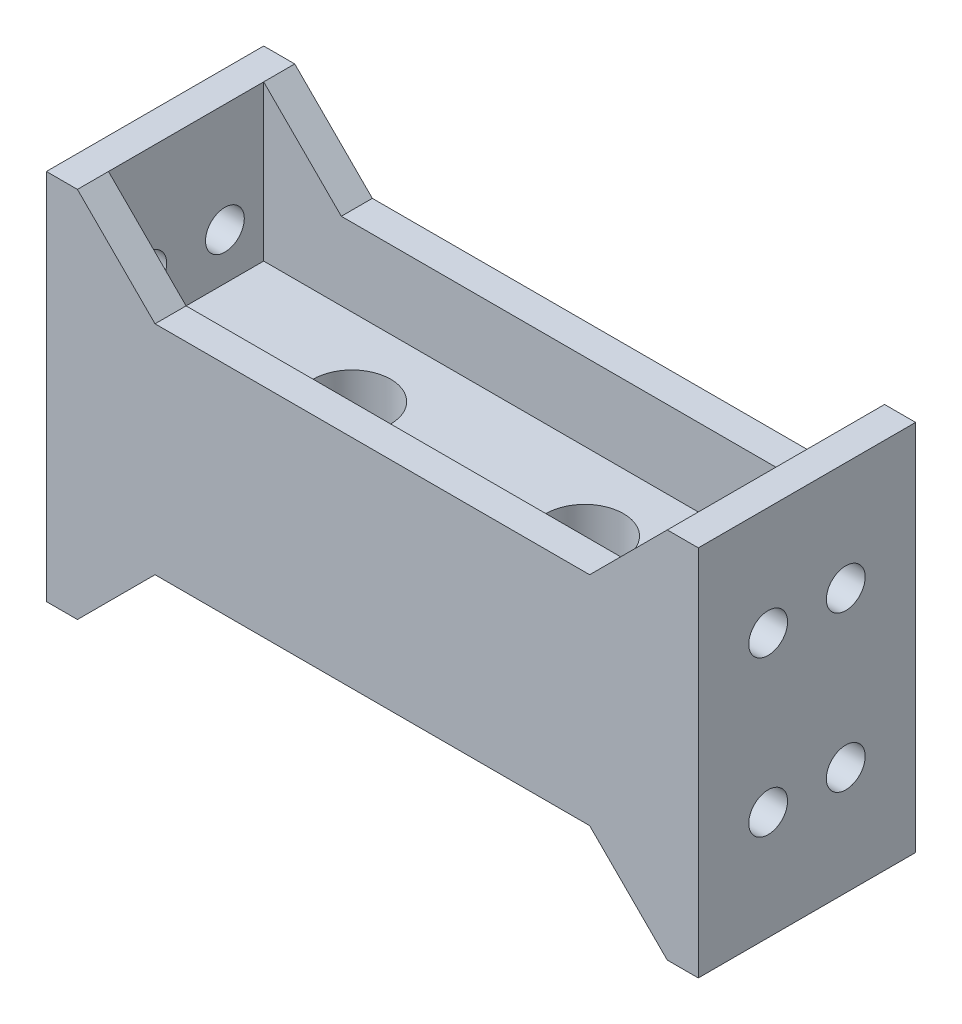
ISO-10303-21;
HEADER;
FILE_DESCRIPTION(('STEP AP214'),'2;1');
FILE_NAME('part.step','',(''),(''),'','','');
FILE_SCHEMA(('AUTOMOTIVE_DESIGN { 1 0 10303 214 1 1 1 1 }'));
ENDSEC;
DATA;
#1=APPLICATION_CONTEXT('core data for automotive mechanical design processes');
#2=APPLICATION_PROTOCOL_DEFINITION('international standard','automotive_design',2000,#1);
#3=PRODUCT_CONTEXT('',#1,'mechanical');
#4=PRODUCT('Part','Part','',(#3));
#5=PRODUCT_RELATED_PRODUCT_CATEGORY('part','',(#4));
#6=PRODUCT_DEFINITION_FORMATION('','',#4);
#7=PRODUCT_DEFINITION_CONTEXT('part definition',#1,'design');
#8=PRODUCT_DEFINITION('design','',#6,#7);
#9=PRODUCT_DEFINITION_SHAPE('','',#8);
#10=(LENGTH_UNIT() NAMED_UNIT(*) SI_UNIT(.MILLI.,.METRE.));
#11=(NAMED_UNIT(*) PLANE_ANGLE_UNIT() SI_UNIT($,.RADIAN.));
#12=(NAMED_UNIT(*) SI_UNIT($,.STERADIAN.) SOLID_ANGLE_UNIT());
#13=UNCERTAINTY_MEASURE_WITH_UNIT(LENGTH_MEASURE(1.E-05),#10,'distance_accuracy_value','');
#14=(GEOMETRIC_REPRESENTATION_CONTEXT(3) GLOBAL_UNCERTAINTY_ASSIGNED_CONTEXT((#13)) GLOBAL_UNIT_ASSIGNED_CONTEXT((#10,
#11,#12)) REPRESENTATION_CONTEXT('',''));
#15=CARTESIAN_POINT('',(0.,0.,0.));
#16=DIRECTION('',(0.,0.,1.));
#17=DIRECTION('',(1.,0.,0.));
#18=AXIS2_PLACEMENT_3D('',#15,#16,#17);
#19=CARTESIAN_POINT('',(0.,4.,0.));
#20=DIRECTION('',(0.,1.,0.));
#21=DIRECTION('',(0.,0.,1.));
#22=AXIS2_PLACEMENT_3D('',#19,#20,#21);
#23=PLANE('',#22);
#24=CARTESIAN_POINT('',(-8.31990662492034,4.,0.));
#25=DIRECTION('',(0.,-1.,0.));
#26=DIRECTION('',(0.,0.,-1.));
#27=AXIS2_PLACEMENT_3D('',#24,#25,#26);
#28=CIRCLE('',#27,2.5);
#29=CARTESIAN_POINT('',(-8.31990662492034,4.,-2.5));
#30=VERTEX_POINT('',#29);
#31=EDGE_CURVE('E284',#30,#30,#28,.T.);
#32=ORIENTED_EDGE('',*,*,#31,.T.);
#33=EDGE_LOOP('',(#32));
#34=FACE_BOUND('',#33,.T.);
#35=CARTESIAN_POINT('',(6.68009337507966,4.,0.));
#36=DIRECTION('',(0.,-1.,0.));
#37=DIRECTION('',(0.,0.,-1.));
#38=AXIS2_PLACEMENT_3D('',#35,#36,#37);
#39=CIRCLE('',#38,2.5);
#40=CARTESIAN_POINT('',(6.68009337507966,4.,-2.5));
#41=VERTEX_POINT('',#40);
#42=EDGE_CURVE('E272',#41,#41,#39,.T.);
#43=ORIENTED_EDGE('',*,*,#42,.T.);
#44=EDGE_LOOP('',(#43));
#45=FACE_BOUND('',#44,.T.);
#46=DIRECTION('',(0.,0.,-1.));
#47=VECTOR('',#46,1.);
#48=CARTESIAN_POINT('',(-19.,4.,-7.));
#49=LINE('',#48,#47);
#50=CARTESIAN_POINT('',(-19.,4.,5.));
#51=VERTEX_POINT('',#50);
#52=CARTESIAN_POINT('',(-19.,4.,-5.));
#53=VERTEX_POINT('',#52);
#54=EDGE_CURVE('E247',#51,#53,#49,.T.);
#55=ORIENTED_EDGE('',*,*,#54,.F.);
#56=DIRECTION('',(-1.,0.,0.));
#57=VECTOR('',#56,1.);
#58=CARTESIAN_POINT('',(19.,4.,5.));
#59=LINE('',#58,#57);
#60=CARTESIAN_POINT('',(19.,4.,5.));
#61=VERTEX_POINT('',#60);
#62=EDGE_CURVE('E206',#61,#51,#59,.T.);
#63=ORIENTED_EDGE('',*,*,#62,.F.);
#64=DIRECTION('',(0.,0.,1.));
#65=VECTOR('',#64,1.);
#66=CARTESIAN_POINT('',(19.,4.,-7.));
#67=LINE('',#66,#65);
#68=CARTESIAN_POINT('',(19.,4.,-5.));
#69=VERTEX_POINT('',#68);
#70=EDGE_CURVE('E451',#69,#61,#67,.T.);
#71=ORIENTED_EDGE('',*,*,#70,.F.);
#72=DIRECTION('',(-1.,0.,0.));
#73=VECTOR('',#72,1.);
#74=CARTESIAN_POINT('',(19.,4.,-5.));
#75=LINE('',#74,#73);
#76=EDGE_CURVE('E527',#69,#53,#75,.T.);
#77=ORIENTED_EDGE('',*,*,#76,.T.);
#78=EDGE_LOOP('',(#55,#63,#71,#77));
#79=FACE_BOUND('',#78,.T.);
#80=ADVANCED_FACE('F39',(#34,#45,#79),#23,.T.);
#81=CARTESIAN_POINT('',(-19.,14.,-7.));
#82=DIRECTION('',(-1.,0.,0.));
#83=DIRECTION('',(0.,0.,1.));
#84=AXIS2_PLACEMENT_3D('',#81,#82,#83);
#85=PLANE('',#84);
#86=CARTESIAN_POINT('',(-19.,7.,2.5));
#87=DIRECTION('',(1.,0.,0.));
#88=DIRECTION('',(0.,0.,-1.));
#89=AXIS2_PLACEMENT_3D('',#86,#87,#88);
#90=CIRCLE('',#89,1.25);
#91=CARTESIAN_POINT('',(-19.,7.,1.25));
#92=VERTEX_POINT('',#91);
#93=EDGE_CURVE('E479',#92,#92,#90,.T.);
#94=ORIENTED_EDGE('',*,*,#93,.F.);
#95=EDGE_LOOP('',(#94));
#96=FACE_BOUND('',#95,.T.);
#97=CARTESIAN_POINT('',(-19.,7.,-2.5));
#98=DIRECTION('',(1.,0.,0.));
#99=DIRECTION('',(0.,0.,-1.));
#100=AXIS2_PLACEMENT_3D('',#97,#98,#99);
#101=CIRCLE('',#100,1.25);
#102=CARTESIAN_POINT('',(-19.,7.,-3.75));
#103=VERTEX_POINT('',#102);
#104=EDGE_CURVE('E480',#103,#103,#101,.T.);
#105=ORIENTED_EDGE('',*,*,#104,.F.);
#106=EDGE_LOOP('',(#105));
#107=FACE_BOUND('',#106,.T.);
#108=DIRECTION('',(0.,1.,0.));
#109=VECTOR('',#108,1.);
#110=CARTESIAN_POINT('',(-19.,14.,5.));
#111=LINE('',#110,#109);
#112=CARTESIAN_POINT('',(-19.,14.,5.));
#113=VERTEX_POINT('',#112);
#114=EDGE_CURVE('E200',#51,#113,#111,.T.);
#115=ORIENTED_EDGE('',*,*,#114,.F.);
#116=ORIENTED_EDGE('',*,*,#54,.T.);
#117=DIRECTION('',(0.,1.,0.));
#118=VECTOR('',#117,1.);
#119=CARTESIAN_POINT('',(-19.,14.,-5.));
#120=LINE('',#119,#118);
#121=CARTESIAN_POINT('',(-19.,14.,-5.));
#122=VERTEX_POINT('',#121);
#123=EDGE_CURVE('E227',#53,#122,#120,.T.);
#124=ORIENTED_EDGE('',*,*,#123,.T.);
#125=DIRECTION('',(0.,0.,-1.));
#126=VECTOR('',#125,1.);
#127=CARTESIAN_POINT('',(-19.,14.,-7.));
#128=LINE('',#127,#126);
#129=EDGE_CURVE('E224',#113,#122,#128,.T.);
#130=ORIENTED_EDGE('',*,*,#129,.F.);
#131=EDGE_LOOP('',(#115,#116,#124,#130));
#132=FACE_BOUND('',#131,.T.);
#133=ADVANCED_FACE('F225',(#96,#107,#132),#85,.F.);
#134=CARTESIAN_POINT('',(19.,14.,-7.));
#135=DIRECTION('',(1.,0.,0.));
#136=DIRECTION('',(0.,0.,-1.));
#137=AXIS2_PLACEMENT_3D('',#134,#135,#136);
#138=PLANE('',#137);
#139=CARTESIAN_POINT('',(19.,7.,2.5));
#140=DIRECTION('',(1.,0.,0.));
#141=DIRECTION('',(0.,0.,-1.));
#142=AXIS2_PLACEMENT_3D('',#139,#140,#141);
#143=CIRCLE('',#142,1.25);
#144=CARTESIAN_POINT('',(19.,7.,1.25));
#145=VERTEX_POINT('',#144);
#146=EDGE_CURVE('E495',#145,#145,#143,.T.);
#147=ORIENTED_EDGE('',*,*,#146,.T.);
#148=EDGE_LOOP('',(#147));
#149=FACE_BOUND('',#148,.T.);
#150=CARTESIAN_POINT('',(19.,7.,-2.5));
#151=DIRECTION('',(1.,0.,0.));
#152=DIRECTION('',(0.,0.,-1.));
#153=AXIS2_PLACEMENT_3D('',#150,#151,#152);
#154=CIRCLE('',#153,1.25);
#155=CARTESIAN_POINT('',(19.,7.,-3.75));
#156=VERTEX_POINT('',#155);
#157=EDGE_CURVE('E496',#156,#156,#154,.T.);
#158=ORIENTED_EDGE('',*,*,#157,.T.);
#159=EDGE_LOOP('',(#158));
#160=FACE_BOUND('',#159,.T.);
#161=DIRECTION('',(0.,-1.,0.));
#162=VECTOR('',#161,1.);
#163=CARTESIAN_POINT('',(19.,14.,5.));
#164=LINE('',#163,#162);
#165=CARTESIAN_POINT('',(19.,14.,5.));
#166=VERTEX_POINT('',#165);
#167=EDGE_CURVE('E567',#166,#61,#164,.T.);
#168=ORIENTED_EDGE('',*,*,#167,.F.);
#169=DIRECTION('',(0.,0.,1.));
#170=VECTOR('',#169,1.);
#171=CARTESIAN_POINT('',(19.,14.,-7.));
#172=LINE('',#171,#170);
#173=CARTESIAN_POINT('',(19.,14.,-5.));
#174=VERTEX_POINT('',#173);
#175=EDGE_CURVE('E464',#174,#166,#172,.T.);
#176=ORIENTED_EDGE('',*,*,#175,.F.);
#177=DIRECTION('',(0.,-1.,0.));
#178=VECTOR('',#177,1.);
#179=CARTESIAN_POINT('',(19.,14.,-5.));
#180=LINE('',#179,#178);
#181=EDGE_CURVE('E531',#174,#69,#180,.T.);
#182=ORIENTED_EDGE('',*,*,#181,.T.);
#183=ORIENTED_EDGE('',*,*,#70,.T.);
#184=EDGE_LOOP('',(#168,#176,#182,#183));
#185=FACE_BOUND('',#184,.T.);
#186=ADVANCED_FACE('F579',(#149,#160,#185),#138,.F.);
#187=CARTESIAN_POINT('',(0.,0.,0.));
#188=DIRECTION('',(0.,1.,0.));
#189=DIRECTION('',(0.,0.,1.));
#190=AXIS2_PLACEMENT_3D('',#187,#188,#189);
#191=PLANE('',#190);
#192=CARTESIAN_POINT('',(-8.31990662492034,0.,0.));
#193=DIRECTION('',(0.,1.,0.));
#194=DIRECTION('',(0.,0.,1.));
#195=AXIS2_PLACEMENT_3D('',#192,#193,#194);
#196=CIRCLE('',#195,2.5);
#197=CARTESIAN_POINT('',(-8.31990662492034,0.,2.5));
#198=VERTEX_POINT('',#197);
#199=EDGE_CURVE('E295',#198,#198,#196,.T.);
#200=ORIENTED_EDGE('',*,*,#199,.T.);
#201=EDGE_LOOP('',(#200));
#202=FACE_BOUND('',#201,.T.);
#203=CARTESIAN_POINT('',(6.68009337507966,0.,0.));
#204=DIRECTION('',(0.,1.,0.));
#205=DIRECTION('',(0.,0.,1.));
#206=AXIS2_PLACEMENT_3D('',#203,#204,#205);
#207=CIRCLE('',#206,2.5);
#208=CARTESIAN_POINT('',(6.68009337507966,0.,2.5));
#209=VERTEX_POINT('',#208);
#210=EDGE_CURVE('E288',#209,#209,#207,.T.);
#211=ORIENTED_EDGE('',*,*,#210,.T.);
#212=EDGE_LOOP('',(#211));
#213=FACE_BOUND('',#212,.T.);
#214=DIRECTION('',(0.,0.,1.));
#215=VECTOR('',#214,1.);
#216=CARTESIAN_POINT('',(-19.,0.,7.));
#217=LINE('',#216,#215);
#218=CARTESIAN_POINT('',(-19.,0.,-5.));
#219=VERTEX_POINT('',#218);
#220=CARTESIAN_POINT('',(-19.,0.,5.));
#221=VERTEX_POINT('',#220);
#222=EDGE_CURVE('E401',#219,#221,#217,.T.);
#223=ORIENTED_EDGE('',*,*,#222,.F.);
#224=DIRECTION('',(-1.,0.,0.));
#225=VECTOR('',#224,1.);
#226=CARTESIAN_POINT('',(-19.,0.,-5.));
#227=LINE('',#226,#225);
#228=CARTESIAN_POINT('',(19.,0.,-5.));
#229=VERTEX_POINT('',#228);
#230=EDGE_CURVE('E304',#229,#219,#227,.T.);
#231=ORIENTED_EDGE('',*,*,#230,.F.);
#232=DIRECTION('',(0.,0.,-1.));
#233=VECTOR('',#232,1.);
#234=CARTESIAN_POINT('',(19.,0.,7.));
#235=LINE('',#234,#233);
#236=CARTESIAN_POINT('',(19.,0.,5.));
#237=VERTEX_POINT('',#236);
#238=EDGE_CURVE('E377',#237,#229,#235,.T.);
#239=ORIENTED_EDGE('',*,*,#238,.F.);
#240=DIRECTION('',(-1.,0.,0.));
#241=VECTOR('',#240,1.);
#242=CARTESIAN_POINT('',(-19.,0.,5.));
#243=LINE('',#242,#241);
#244=EDGE_CURVE('E359',#237,#221,#243,.T.);
#245=ORIENTED_EDGE('',*,*,#244,.T.);
#246=EDGE_LOOP('',(#223,#231,#239,#245));
#247=FACE_BOUND('',#246,.T.);
#248=ADVANCED_FACE('F618',(#202,#213,#247),#191,.F.);
#249=CARTESIAN_POINT('',(21.,4.,-7.));
#250=DIRECTION('',(-1.,0.,0.));
#251=DIRECTION('',(0.,0.,1.));
#252=AXIS2_PLACEMENT_3D('',#249,#250,#251);
#253=PLANE('',#252);
#254=CARTESIAN_POINT('',(21.,7.,2.5));
#255=DIRECTION('',(-1.,0.,0.));
#256=DIRECTION('',(0.,0.,1.));
#257=AXIS2_PLACEMENT_3D('',#254,#255,#256);
#258=CIRCLE('',#257,1.25);
#259=CARTESIAN_POINT('',(21.,7.,3.75));
#260=VERTEX_POINT('',#259);
#261=EDGE_CURVE('E484',#260,#260,#258,.F.);
#262=ORIENTED_EDGE('',*,*,#261,.F.);
#263=EDGE_LOOP('',(#262));
#264=FACE_BOUND('',#263,.T.);
#265=CARTESIAN_POINT('',(21.,7.,-2.5));
#266=DIRECTION('',(-1.,0.,0.));
#267=DIRECTION('',(0.,0.,1.));
#268=AXIS2_PLACEMENT_3D('',#265,#266,#267);
#269=CIRCLE('',#268,1.25);
#270=CARTESIAN_POINT('',(21.,7.,-1.25));
#271=VERTEX_POINT('',#270);
#272=EDGE_CURVE('E491',#271,#271,#269,.F.);
#273=ORIENTED_EDGE('',*,*,#272,.F.);
#274=EDGE_LOOP('',(#273));
#275=FACE_BOUND('',#274,.T.);
#276=CARTESIAN_POINT('',(21.,-3.,2.5));
#277=DIRECTION('',(1.,0.,0.));
#278=DIRECTION('',(0.,0.,-1.));
#279=AXIS2_PLACEMENT_3D('',#276,#277,#278);
#280=CIRCLE('',#279,1.25);
#281=CARTESIAN_POINT('',(21.,-3.,1.25));
#282=VERTEX_POINT('',#281);
#283=EDGE_CURVE('E252',#282,#282,#280,.T.);
#284=ORIENTED_EDGE('',*,*,#283,.F.);
#285=EDGE_LOOP('',(#284));
#286=FACE_BOUND('',#285,.T.);
#287=CARTESIAN_POINT('',(21.,-3.,-2.5));
#288=DIRECTION('',(1.,0.,0.));
#289=DIRECTION('',(0.,0.,-1.));
#290=AXIS2_PLACEMENT_3D('',#287,#288,#289);
#291=CIRCLE('',#290,1.25);
#292=CARTESIAN_POINT('',(21.,-3.,-3.75));
#293=VERTEX_POINT('',#292);
#294=EDGE_CURVE('E261',#293,#293,#291,.T.);
#295=ORIENTED_EDGE('',*,*,#294,.F.);
#296=EDGE_LOOP('',(#295));
#297=FACE_BOUND('',#296,.T.);
#298=DIRECTION('',(0.,-1.,0.));
#299=VECTOR('',#298,1.);
#300=CARTESIAN_POINT('',(21.,4.,7.));
#301=LINE('',#300,#299);
#302=CARTESIAN_POINT('',(21.,14.,7.));
#303=VERTEX_POINT('',#302);
#304=CARTESIAN_POINT('',(21.,-10.,7.));
#305=VERTEX_POINT('',#304);
#306=EDGE_CURVE('E422',#303,#305,#301,.T.);
#307=ORIENTED_EDGE('',*,*,#306,.T.);
#308=DIRECTION('',(0.,0.,1.));
#309=VECTOR('',#308,1.);
#310=CARTESIAN_POINT('',(21.,-10.,7.));
#311=LINE('',#310,#309);
#312=CARTESIAN_POINT('',(21.,-10.,-7.));
#313=VERTEX_POINT('',#312);
#314=EDGE_CURVE('E384',#313,#305,#311,.T.);
#315=ORIENTED_EDGE('',*,*,#314,.F.);
#316=DIRECTION('',(0.,-1.,0.));
#317=VECTOR('',#316,1.);
#318=CARTESIAN_POINT('',(21.,4.,-7.));
#319=LINE('',#318,#317);
#320=CARTESIAN_POINT('',(21.,14.,-7.));
#321=VERTEX_POINT('',#320);
#322=EDGE_CURVE('E11',#321,#313,#319,.T.);
#323=ORIENTED_EDGE('',*,*,#322,.F.);
#324=DIRECTION('',(0.,0.,-1.));
#325=VECTOR('',#324,1.);
#326=CARTESIAN_POINT('',(21.,14.,-7.));
#327=LINE('',#326,#325);
#328=EDGE_CURVE('E455',#303,#321,#327,.T.);
#329=ORIENTED_EDGE('',*,*,#328,.F.);
#330=EDGE_LOOP('',(#307,#315,#323,#329));
#331=FACE_BOUND('',#330,.T.);
#332=ADVANCED_FACE('F41',(#264,#275,#286,#297,#331),#253,.F.);
#333=CARTESIAN_POINT('',(-21.,4.,-7.));
#334=DIRECTION('',(0.,0.,1.));
#335=DIRECTION('',(1.,0.,0.));
#336=AXIS2_PLACEMENT_3D('',#333,#334,#335);
#337=PLANE('',#336);
#338=ORIENTED_EDGE('',*,*,#322,.T.);
#339=DIRECTION('',(1.,0.,0.));
#340=VECTOR('',#339,1.);
#341=CARTESIAN_POINT('',(21.,-10.,-7.));
#342=LINE('',#341,#340);
#343=CARTESIAN_POINT('',(19.,-10.,-7.));
#344=VERTEX_POINT('',#343);
#345=EDGE_CURVE('E397',#344,#313,#342,.T.);
#346=ORIENTED_EDGE('',*,*,#345,.F.);
#347=DIRECTION('',(0.707106781186551,-0.707106781186544,0.));
#348=VECTOR('',#347,1.);
#349=CARTESIAN_POINT('',(19.,-10.,-7.));
#350=LINE('',#349,#348);
#351=CARTESIAN_POINT('',(14.,-5.,-7.));
#352=VERTEX_POINT('',#351);
#353=EDGE_CURVE('E299',#352,#344,#350,.T.);
#354=ORIENTED_EDGE('',*,*,#353,.F.);
#355=DIRECTION('',(1.,0.,0.));
#356=VECTOR('',#355,1.);
#357=CARTESIAN_POINT('',(-14.,-5.,-7.));
#358=LINE('',#357,#356);
#359=CARTESIAN_POINT('',(-14.,-5.,-7.));
#360=VERTEX_POINT('',#359);
#361=EDGE_CURVE('E323',#360,#352,#358,.T.);
#362=ORIENTED_EDGE('',*,*,#361,.F.);
#363=DIRECTION('',(0.707106781186548,0.707106781186547,0.));
#364=VECTOR('',#363,1.);
#365=CARTESIAN_POINT('',(-19.,-10.,-7.));
#366=LINE('',#365,#364);
#367=CARTESIAN_POINT('',(-19.,-10.,-7.));
#368=VERTEX_POINT('',#367);
#369=EDGE_CURVE('E305',#368,#360,#366,.T.);
#370=ORIENTED_EDGE('',*,*,#369,.F.);
#371=DIRECTION('',(1.,0.,0.));
#372=VECTOR('',#371,1.);
#373=CARTESIAN_POINT('',(-21.,-10.,-7.));
#374=LINE('',#373,#372);
#375=CARTESIAN_POINT('',(-21.,-10.,-7.));
#376=VERTEX_POINT('',#375);
#377=EDGE_CURVE('E409',#376,#368,#374,.T.);
#378=ORIENTED_EDGE('',*,*,#377,.F.);
#379=DIRECTION('',(0.,-1.,0.));
#380=VECTOR('',#379,1.);
#381=CARTESIAN_POINT('',(-21.,4.,-7.));
#382=LINE('',#381,#380);
#383=CARTESIAN_POINT('',(-21.,14.,-7.));
#384=VERTEX_POINT('',#383);
#385=EDGE_CURVE('E48',#384,#376,#382,.T.);
#386=ORIENTED_EDGE('',*,*,#385,.F.);
#387=DIRECTION('',(-1.,0.,0.));
#388=VECTOR('',#387,1.);
#389=CARTESIAN_POINT('',(-21.,14.,-7.));
#390=LINE('',#389,#388);
#391=CARTESIAN_POINT('',(-19.,14.,-7.));
#392=VERTEX_POINT('',#391);
#393=EDGE_CURVE('E239',#392,#384,#390,.T.);
#394=ORIENTED_EDGE('',*,*,#393,.F.);
#395=DIRECTION('',(0.707106781186541,-0.707106781186554,0.));
#396=VECTOR('',#395,1.);
#397=CARTESIAN_POINT('',(-19.,14.,-7.));
#398=LINE('',#397,#396);
#399=CARTESIAN_POINT('',(-14.0000000000001,9.,-7.));
#400=VERTEX_POINT('',#399);
#401=EDGE_CURVE('E521',#392,#400,#398,.T.);
#402=ORIENTED_EDGE('',*,*,#401,.T.);
#403=DIRECTION('',(1.,0.,0.));
#404=VECTOR('',#403,1.);
#405=CARTESIAN_POINT('',(14.,9.,-7.));
#406=LINE('',#405,#404);
#407=CARTESIAN_POINT('',(14.,9.,-7.));
#408=VERTEX_POINT('',#407);
#409=EDGE_CURVE('E517',#400,#408,#406,.T.);
#410=ORIENTED_EDGE('',*,*,#409,.T.);
#411=DIRECTION('',(0.707106781186548,0.707106781186547,0.));
#412=VECTOR('',#411,1.);
#413=CARTESIAN_POINT('',(19.,14.,-7.));
#414=LINE('',#413,#412);
#415=CARTESIAN_POINT('',(19.,14.,-7.));
#416=VERTEX_POINT('',#415);
#417=EDGE_CURVE('E512',#408,#416,#414,.T.);
#418=ORIENTED_EDGE('',*,*,#417,.T.);
#419=DIRECTION('',(-1.,0.,0.));
#420=VECTOR('',#419,1.);
#421=CARTESIAN_POINT('',(21.,14.,-7.));
#422=LINE('',#421,#420);
#423=EDGE_CURVE('E465',#321,#416,#422,.T.);
#424=ORIENTED_EDGE('',*,*,#423,.F.);
#425=EDGE_LOOP('',(#338,#346,#354,#362,#370,#378,#386,#394,#402,#410,#418,#424));
#426=FACE_BOUND('',#425,.T.);
#427=ADVANCED_FACE('F437',(#426),#337,.F.);
#428=CARTESIAN_POINT('',(-21.,4.,-7.));
#429=DIRECTION('',(1.,0.,0.));
#430=DIRECTION('',(0.,0.,-1.));
#431=AXIS2_PLACEMENT_3D('',#428,#429,#430);
#432=PLANE('',#431);
#433=CARTESIAN_POINT('',(-21.,7.,2.5));
#434=DIRECTION('',(1.,0.,0.));
#435=DIRECTION('',(0.,0.,-1.));
#436=AXIS2_PLACEMENT_3D('',#433,#434,#435);
#437=CIRCLE('',#436,1.25);
#438=CARTESIAN_POINT('',(-21.,7.,1.25));
#439=VERTEX_POINT('',#438);
#440=EDGE_CURVE('E456',#439,#439,#437,.T.);
#441=ORIENTED_EDGE('',*,*,#440,.T.);
#442=EDGE_LOOP('',(#441));
#443=FACE_BOUND('',#442,.T.);
#444=CARTESIAN_POINT('',(-21.,7.,-2.5));
#445=DIRECTION('',(1.,0.,0.));
#446=DIRECTION('',(0.,0.,-1.));
#447=AXIS2_PLACEMENT_3D('',#444,#445,#446);
#448=CIRCLE('',#447,1.25);
#449=CARTESIAN_POINT('',(-21.,7.,-3.75));
#450=VERTEX_POINT('',#449);
#451=EDGE_CURVE('E475',#450,#450,#448,.T.);
#452=ORIENTED_EDGE('',*,*,#451,.T.);
#453=EDGE_LOOP('',(#452));
#454=FACE_BOUND('',#453,.T.);
#455=CARTESIAN_POINT('',(-21.,-3.,2.5));
#456=DIRECTION('',(1.,0.,0.));
#457=DIRECTION('',(0.,0.,-1.));
#458=AXIS2_PLACEMENT_3D('',#455,#456,#457);
#459=CIRCLE('',#458,1.25);
#460=CARTESIAN_POINT('',(-21.,-3.,1.25));
#461=VERTEX_POINT('',#460);
#462=EDGE_CURVE('E268',#461,#461,#459,.T.);
#463=ORIENTED_EDGE('',*,*,#462,.T.);
#464=EDGE_LOOP('',(#463));
#465=FACE_BOUND('',#464,.T.);
#466=CARTESIAN_POINT('',(-21.,-3.,-2.5));
#467=DIRECTION('',(1.,0.,0.));
#468=DIRECTION('',(0.,0.,-1.));
#469=AXIS2_PLACEMENT_3D('',#466,#467,#468);
#470=CIRCLE('',#469,1.25);
#471=CARTESIAN_POINT('',(-21.,-3.,-3.75));
#472=VERTEX_POINT('',#471);
#473=EDGE_CURVE('E277',#472,#472,#470,.T.);
#474=ORIENTED_EDGE('',*,*,#473,.T.);
#475=EDGE_LOOP('',(#474));
#476=FACE_BOUND('',#475,.T.);
#477=ORIENTED_EDGE('',*,*,#385,.T.);
#478=DIRECTION('',(0.,0.,-1.));
#479=VECTOR('',#478,1.);
#480=CARTESIAN_POINT('',(-21.,-10.,7.));
#481=LINE('',#480,#479);
#482=CARTESIAN_POINT('',(-21.,-10.,7.));
#483=VERTEX_POINT('',#482);
#484=EDGE_CURVE('E405',#483,#376,#481,.T.);
#485=ORIENTED_EDGE('',*,*,#484,.F.);
#486=DIRECTION('',(0.,-1.,0.));
#487=VECTOR('',#486,1.);
#488=CARTESIAN_POINT('',(-21.,4.,7.));
#489=LINE('',#488,#487);
#490=CARTESIAN_POINT('',(-21.,14.,7.));
#491=VERTEX_POINT('',#490);
#492=EDGE_CURVE('E427',#491,#483,#489,.T.);
#493=ORIENTED_EDGE('',*,*,#492,.F.);
#494=DIRECTION('',(0.,0.,1.));
#495=VECTOR('',#494,1.);
#496=CARTESIAN_POINT('',(-21.,14.,-7.));
#497=LINE('',#496,#495);
#498=EDGE_CURVE('E250',#384,#491,#497,.T.);
#499=ORIENTED_EDGE('',*,*,#498,.F.);
#500=EDGE_LOOP('',(#477,#485,#493,#499));
#501=FACE_BOUND('',#500,.T.);
#502=ADVANCED_FACE('F434',(#443,#454,#465,#476,#501),#432,.F.);
#503=CARTESIAN_POINT('',(-21.,4.,7.));
#504=DIRECTION('',(0.,0.,-1.));
#505=DIRECTION('',(-1.,0.,0.));
#506=AXIS2_PLACEMENT_3D('',#503,#504,#505);
#507=PLANE('',#506);
#508=DIRECTION('',(1.,0.,0.));
#509=VECTOR('',#508,1.);
#510=CARTESIAN_POINT('',(21.,14.,7.));
#511=LINE('',#510,#509);
#512=CARTESIAN_POINT('',(19.,14.,7.));
#513=VERTEX_POINT('',#512);
#514=EDGE_CURVE('E251',#513,#303,#511,.T.);
#515=ORIENTED_EDGE('',*,*,#514,.F.);
#516=DIRECTION('',(0.707106781186548,0.707106781186547,0.));
#517=VECTOR('',#516,1.);
#518=CARTESIAN_POINT('',(19.,14.,7.));
#519=LINE('',#518,#517);
#520=CARTESIAN_POINT('',(14.,9.,7.));
#521=VERTEX_POINT('',#520);
#522=EDGE_CURVE('E557',#521,#513,#519,.T.);
#523=ORIENTED_EDGE('',*,*,#522,.F.);
#524=DIRECTION('',(1.,0.,0.));
#525=VECTOR('',#524,1.);
#526=CARTESIAN_POINT('',(14.,9.,7.));
#527=LINE('',#526,#525);
#528=CARTESIAN_POINT('',(-14.0000000000001,9.,7.));
#529=VERTEX_POINT('',#528);
#530=EDGE_CURVE('E221',#529,#521,#527,.T.);
#531=ORIENTED_EDGE('',*,*,#530,.F.);
#532=DIRECTION('',(0.707106781186541,-0.707106781186554,0.));
#533=VECTOR('',#532,1.);
#534=CARTESIAN_POINT('',(-19.,14.,7.));
#535=LINE('',#534,#533);
#536=CARTESIAN_POINT('',(-19.,14.,7.));
#537=VERTEX_POINT('',#536);
#538=EDGE_CURVE('E447',#537,#529,#535,.T.);
#539=ORIENTED_EDGE('',*,*,#538,.F.);
#540=DIRECTION('',(1.,0.,0.));
#541=VECTOR('',#540,1.);
#542=CARTESIAN_POINT('',(-21.,14.,7.));
#543=LINE('',#542,#541);
#544=EDGE_CURVE('E232',#491,#537,#543,.T.);
#545=ORIENTED_EDGE('',*,*,#544,.F.);
#546=ORIENTED_EDGE('',*,*,#492,.T.);
#547=DIRECTION('',(-1.,0.,0.));
#548=VECTOR('',#547,1.);
#549=CARTESIAN_POINT('',(-21.,-10.,7.));
#550=LINE('',#549,#548);
#551=CARTESIAN_POINT('',(-19.,-10.,7.));
#552=VERTEX_POINT('',#551);
#553=EDGE_CURVE('E418',#552,#483,#550,.T.);
#554=ORIENTED_EDGE('',*,*,#553,.F.);
#555=DIRECTION('',(0.707106781186548,0.707106781186547,0.));
#556=VECTOR('',#555,1.);
#557=CARTESIAN_POINT('',(-19.,-10.,7.));
#558=LINE('',#557,#556);
#559=CARTESIAN_POINT('',(-14.,-5.,7.));
#560=VERTEX_POINT('',#559);
#561=EDGE_CURVE('E332',#552,#560,#558,.T.);
#562=ORIENTED_EDGE('',*,*,#561,.T.);
#563=DIRECTION('',(1.,0.,0.));
#564=VECTOR('',#563,1.);
#565=CARTESIAN_POINT('',(-14.,-5.,7.));
#566=LINE('',#565,#564);
#567=CARTESIAN_POINT('',(14.,-5.,7.));
#568=VERTEX_POINT('',#567);
#569=EDGE_CURVE('E367',#560,#568,#566,.T.);
#570=ORIENTED_EDGE('',*,*,#569,.T.);
#571=DIRECTION('',(0.707106781186551,-0.707106781186544,0.));
#572=VECTOR('',#571,1.);
#573=CARTESIAN_POINT('',(19.,-10.,7.));
#574=LINE('',#573,#572);
#575=CARTESIAN_POINT('',(19.,-10.,7.));
#576=VERTEX_POINT('',#575);
#577=EDGE_CURVE('E345',#568,#576,#574,.T.);
#578=ORIENTED_EDGE('',*,*,#577,.T.);
#579=DIRECTION('',(-1.,0.,0.));
#580=VECTOR('',#579,1.);
#581=CARTESIAN_POINT('',(21.,-10.,7.));
#582=LINE('',#581,#580);
#583=EDGE_CURVE('E388',#305,#576,#582,.T.);
#584=ORIENTED_EDGE('',*,*,#583,.F.);
#585=ORIENTED_EDGE('',*,*,#306,.F.);
#586=EDGE_LOOP('',(#515,#523,#531,#539,#545,#546,#554,#562,#570,#578,#584,#585));
#587=FACE_BOUND('',#586,.T.);
#588=ADVANCED_FACE('F446',(#587),#507,.F.);
#589=CARTESIAN_POINT('',(-19.,-10.,7.));
#590=DIRECTION('',(-1.,0.,0.));
#591=DIRECTION('',(0.,0.,1.));
#592=AXIS2_PLACEMENT_3D('',#589,#590,#591);
#593=PLANE('',#592);
#594=CARTESIAN_POINT('',(-19.,-3.,2.5));
#595=DIRECTION('',(1.,0.,0.));
#596=DIRECTION('',(0.,0.,-1.));
#597=AXIS2_PLACEMENT_3D('',#594,#595,#596);
#598=CIRCLE('',#597,1.25);
#599=CARTESIAN_POINT('',(-19.,-3.,1.25));
#600=VERTEX_POINT('',#599);
#601=EDGE_CURVE('E273',#600,#600,#598,.T.);
#602=ORIENTED_EDGE('',*,*,#601,.F.);
#603=EDGE_LOOP('',(#602));
#604=FACE_BOUND('',#603,.T.);
#605=CARTESIAN_POINT('',(-19.,-3.,-2.5));
#606=DIRECTION('',(1.,0.,0.));
#607=DIRECTION('',(0.,0.,-1.));
#608=AXIS2_PLACEMENT_3D('',#605,#606,#607);
#609=CIRCLE('',#608,1.25);
#610=CARTESIAN_POINT('',(-19.,-3.,-3.75));
#611=VERTEX_POINT('',#610);
#612=EDGE_CURVE('E256',#611,#611,#609,.T.);
#613=ORIENTED_EDGE('',*,*,#612,.F.);
#614=EDGE_LOOP('',(#613));
#615=FACE_BOUND('',#614,.T.);
#616=DIRECTION('',(0.,0.,1.));
#617=VECTOR('',#616,1.);
#618=CARTESIAN_POINT('',(-19.,-10.,7.));
#619=LINE('',#618,#617);
#620=CARTESIAN_POINT('',(-19.,-10.,-5.));
#621=VERTEX_POINT('',#620);
#622=CARTESIAN_POINT('',(-19.,-10.,5.));
#623=VERTEX_POINT('',#622);
#624=EDGE_CURVE('E413',#621,#623,#619,.T.);
#625=ORIENTED_EDGE('',*,*,#624,.F.);
#626=DIRECTION('',(0.,-1.,0.));
#627=VECTOR('',#626,1.);
#628=CARTESIAN_POINT('',(-19.,-10.,-5.));
#629=LINE('',#628,#627);
#630=EDGE_CURVE('E300',#219,#621,#629,.T.);
#631=ORIENTED_EDGE('',*,*,#630,.F.);
#632=ORIENTED_EDGE('',*,*,#222,.T.);
#633=DIRECTION('',(0.,-1.,0.));
#634=VECTOR('',#633,1.);
#635=CARTESIAN_POINT('',(-19.,-10.,5.));
#636=LINE('',#635,#634);
#637=EDGE_CURVE('E340',#221,#623,#636,.T.);
#638=ORIENTED_EDGE('',*,*,#637,.T.);
#639=EDGE_LOOP('',(#625,#631,#632,#638));
#640=FACE_BOUND('',#639,.T.);
#641=ADVANCED_FACE('F616',(#604,#615,#640),#593,.F.);
#642=CARTESIAN_POINT('',(0.,-10.,0.));
#643=DIRECTION('',(0.,-1.,0.));
#644=DIRECTION('',(0.,0.,-1.));
#645=AXIS2_PLACEMENT_3D('',#642,#643,#644);
#646=PLANE('',#645);
#647=ORIENTED_EDGE('',*,*,#484,.T.);
#648=ORIENTED_EDGE('',*,*,#377,.T.);
#649=EDGE_CURVE('E414',#368,#621,#619,.T.);
#650=ORIENTED_EDGE('',*,*,#649,.T.);
#651=ORIENTED_EDGE('',*,*,#624,.T.);
#652=DIRECTION('',(0.,0.,1.));
#653=VECTOR('',#652,1.);
#654=CARTESIAN_POINT('',(-19.,-10.,5.));
#655=LINE('',#654,#653);
#656=EDGE_CURVE('E363',#623,#552,#655,.T.);
#657=ORIENTED_EDGE('',*,*,#656,.T.);
#658=ORIENTED_EDGE('',*,*,#553,.T.);
#659=EDGE_LOOP('',(#647,#648,#650,#651,#657,#658));
#660=FACE_BOUND('',#659,.T.);
#661=ADVANCED_FACE('F441',(#660),#646,.T.);
#662=CARTESIAN_POINT('',(19.,-10.,7.));
#663=DIRECTION('',(1.,0.,0.));
#664=DIRECTION('',(0.,0.,-1.));
#665=AXIS2_PLACEMENT_3D('',#662,#663,#664);
#666=PLANE('',#665);
#667=CARTESIAN_POINT('',(19.,-3.,2.5));
#668=DIRECTION('',(1.,0.,0.));
#669=DIRECTION('',(0.,0.,-1.));
#670=AXIS2_PLACEMENT_3D('',#667,#668,#669);
#671=CIRCLE('',#670,1.25);
#672=CARTESIAN_POINT('',(19.,-3.,1.25));
#673=VERTEX_POINT('',#672);
#674=EDGE_CURVE('E257',#673,#673,#671,.T.);
#675=ORIENTED_EDGE('',*,*,#674,.T.);
#676=EDGE_LOOP('',(#675));
#677=FACE_BOUND('',#676,.T.);
#678=CARTESIAN_POINT('',(19.,-3.,-2.5));
#679=DIRECTION('',(1.,0.,0.));
#680=DIRECTION('',(0.,0.,-1.));
#681=AXIS2_PLACEMENT_3D('',#678,#679,#680);
#682=CIRCLE('',#681,1.25);
#683=CARTESIAN_POINT('',(19.,-3.,-3.75));
#684=VERTEX_POINT('',#683);
#685=EDGE_CURVE('E242',#684,#684,#682,.T.);
#686=ORIENTED_EDGE('',*,*,#685,.T.);
#687=EDGE_LOOP('',(#686));
#688=FACE_BOUND('',#687,.T.);
#689=ORIENTED_EDGE('',*,*,#238,.T.);
#690=DIRECTION('',(0.,1.,0.));
#691=VECTOR('',#690,1.);
#692=CARTESIAN_POINT('',(19.,-10.,-5.));
#693=LINE('',#692,#691);
#694=CARTESIAN_POINT('',(19.,-10.,-5.));
#695=VERTEX_POINT('',#694);
#696=EDGE_CURVE('E308',#695,#229,#693,.T.);
#697=ORIENTED_EDGE('',*,*,#696,.F.);
#698=DIRECTION('',(0.,0.,-1.));
#699=VECTOR('',#698,1.);
#700=CARTESIAN_POINT('',(19.,-10.,7.));
#701=LINE('',#700,#699);
#702=CARTESIAN_POINT('',(19.,-10.,5.));
#703=VERTEX_POINT('',#702);
#704=EDGE_CURVE('E392',#703,#695,#701,.T.);
#705=ORIENTED_EDGE('',*,*,#704,.F.);
#706=DIRECTION('',(0.,1.,0.));
#707=VECTOR('',#706,1.);
#708=CARTESIAN_POINT('',(19.,-10.,5.));
#709=LINE('',#708,#707);
#710=EDGE_CURVE('E355',#703,#237,#709,.T.);
#711=ORIENTED_EDGE('',*,*,#710,.T.);
#712=EDGE_LOOP('',(#689,#697,#705,#711));
#713=FACE_BOUND('',#712,.T.);
#714=ADVANCED_FACE('F812',(#677,#688,#713),#666,.F.);
#715=CARTESIAN_POINT('',(0.,-10.,0.));
#716=DIRECTION('',(0.,1.,0.));
#717=DIRECTION('',(0.,0.,1.));
#718=AXIS2_PLACEMENT_3D('',#715,#716,#717);
#719=PLANE('',#718);
#720=ORIENTED_EDGE('',*,*,#314,.T.);
#721=ORIENTED_EDGE('',*,*,#583,.T.);
#722=EDGE_CURVE('E393',#576,#703,#701,.T.);
#723=ORIENTED_EDGE('',*,*,#722,.T.);
#724=ORIENTED_EDGE('',*,*,#704,.T.);
#725=DIRECTION('',(0.,0.,-1.));
#726=VECTOR('',#725,1.);
#727=CARTESIAN_POINT('',(19.,-10.,-5.));
#728=LINE('',#727,#726);
#729=EDGE_CURVE('E320',#695,#344,#728,.T.);
#730=ORIENTED_EDGE('',*,*,#729,.T.);
#731=ORIENTED_EDGE('',*,*,#345,.T.);
#732=EDGE_LOOP('',(#720,#721,#723,#724,#730,#731));
#733=FACE_BOUND('',#732,.T.);
#734=ADVANCED_FACE('F646',(#733),#719,.F.);
#735=CARTESIAN_POINT('',(19.,-10.,5.));
#736=DIRECTION('',(-0.707106781186544,-0.707106781186551,0.));
#737=DIRECTION('',(0.707106781186551,-0.707106781186544,0.));
#738=AXIS2_PLACEMENT_3D('',#735,#736,#737);
#739=PLANE('',#738);
#740=ORIENTED_EDGE('',*,*,#577,.F.);
#741=DIRECTION('',(0.,0.,1.));
#742=VECTOR('',#741,1.);
#743=CARTESIAN_POINT('',(14.,-5.,5.));
#744=LINE('',#743,#742);
#745=CARTESIAN_POINT('',(14.,-5.,5.));
#746=VERTEX_POINT('',#745);
#747=EDGE_CURVE('E374',#746,#568,#744,.T.);
#748=ORIENTED_EDGE('',*,*,#747,.F.);
#749=DIRECTION('',(0.707106781186551,-0.707106781186544,0.));
#750=VECTOR('',#749,1.);
#751=CARTESIAN_POINT('',(19.,-10.,5.));
#752=LINE('',#751,#750);
#753=EDGE_CURVE('E63',#746,#703,#752,.T.);
#754=ORIENTED_EDGE('',*,*,#753,.T.);
#755=ORIENTED_EDGE('',*,*,#722,.F.);
#756=EDGE_LOOP('',(#740,#748,#754,#755));
#757=FACE_BOUND('',#756,.T.);
#758=ADVANCED_FACE('F962',(#757),#739,.T.);
#759=CARTESIAN_POINT('',(-14.,-5.,5.));
#760=DIRECTION('',(0.,-1.,0.));
#761=DIRECTION('',(1.,0.,0.));
#762=AXIS2_PLACEMENT_3D('',#759,#760,#761);
#763=PLANE('',#762);
#764=ORIENTED_EDGE('',*,*,#569,.F.);
#765=DIRECTION('',(0.,0.,1.));
#766=VECTOR('',#765,1.);
#767=CARTESIAN_POINT('',(-14.,-5.,5.));
#768=LINE('',#767,#766);
#769=CARTESIAN_POINT('',(-14.,-5.,5.));
#770=VERTEX_POINT('',#769);
#771=EDGE_CURVE('E378',#770,#560,#768,.T.);
#772=ORIENTED_EDGE('',*,*,#771,.F.);
#773=DIRECTION('',(1.,0.,0.));
#774=VECTOR('',#773,1.);
#775=CARTESIAN_POINT('',(-14.,-5.,5.));
#776=LINE('',#775,#774);
#777=EDGE_CURVE('E349',#770,#746,#776,.T.);
#778=ORIENTED_EDGE('',*,*,#777,.T.);
#779=ORIENTED_EDGE('',*,*,#747,.T.);
#780=EDGE_LOOP('',(#764,#772,#778,#779));
#781=FACE_BOUND('',#780,.T.);
#782=ADVANCED_FACE('F965',(#781),#763,.T.);
#783=CARTESIAN_POINT('',(-19.,-10.,5.));
#784=DIRECTION('',(0.707106781186547,-0.707106781186548,0.));
#785=DIRECTION('',(0.707106781186548,0.707106781186547,0.));
#786=AXIS2_PLACEMENT_3D('',#783,#784,#785);
#787=PLANE('',#786);
#788=ORIENTED_EDGE('',*,*,#561,.F.);
#789=ORIENTED_EDGE('',*,*,#656,.F.);
#790=DIRECTION('',(0.707106781186548,0.707106781186547,0.));
#791=VECTOR('',#790,1.);
#792=CARTESIAN_POINT('',(-19.,-10.,5.));
#793=LINE('',#792,#791);
#794=EDGE_CURVE('E344',#623,#770,#793,.T.);
#795=ORIENTED_EDGE('',*,*,#794,.T.);
#796=ORIENTED_EDGE('',*,*,#771,.T.);
#797=EDGE_LOOP('',(#788,#789,#795,#796));
#798=FACE_BOUND('',#797,.T.);
#799=ADVANCED_FACE('F960',(#798),#787,.T.);
#800=CARTESIAN_POINT('',(0.,0.,5.));
#801=DIRECTION('',(0.,0.,-1.));
#802=DIRECTION('',(-1.,0.,0.));
#803=AXIS2_PLACEMENT_3D('',#800,#801,#802);
#804=PLANE('',#803);
#805=ORIENTED_EDGE('',*,*,#637,.F.);
#806=ORIENTED_EDGE('',*,*,#244,.F.);
#807=ORIENTED_EDGE('',*,*,#710,.F.);
#808=ORIENTED_EDGE('',*,*,#753,.F.);
#809=ORIENTED_EDGE('',*,*,#777,.F.);
#810=ORIENTED_EDGE('',*,*,#794,.F.);
#811=EDGE_LOOP('',(#805,#806,#807,#808,#809,#810));
#812=FACE_BOUND('',#811,.T.);
#813=ADVANCED_FACE('F921',(#812),#804,.T.);
#814=CARTESIAN_POINT('',(-19.,-10.,-5.));
#815=DIRECTION('',(-0.707106781186547,0.707106781186548,0.));
#816=DIRECTION('',(-0.707106781186548,-0.707106781186547,0.));
#817=AXIS2_PLACEMENT_3D('',#814,#815,#816);
#818=PLANE('',#817);
#819=ORIENTED_EDGE('',*,*,#369,.T.);
#820=DIRECTION('',(0.,0.,-1.));
#821=VECTOR('',#820,1.);
#822=CARTESIAN_POINT('',(-14.,-5.,-5.));
#823=LINE('',#822,#821);
#824=CARTESIAN_POINT('',(-14.,-5.,-5.));
#825=VERTEX_POINT('',#824);
#826=EDGE_CURVE('E328',#825,#360,#823,.T.);
#827=ORIENTED_EDGE('',*,*,#826,.F.);
#828=DIRECTION('',(0.707106781186548,0.707106781186547,0.));
#829=VECTOR('',#828,1.);
#830=CARTESIAN_POINT('',(-19.,-10.,-5.));
#831=LINE('',#830,#829);
#832=EDGE_CURVE('E317',#621,#825,#831,.T.);
#833=ORIENTED_EDGE('',*,*,#832,.F.);
#834=ORIENTED_EDGE('',*,*,#649,.F.);
#835=EDGE_LOOP('',(#819,#827,#833,#834));
#836=FACE_BOUND('',#835,.T.);
#837=ADVANCED_FACE('F926',(#836),#818,.F.);
#838=CARTESIAN_POINT('',(-14.,-5.,-5.));
#839=DIRECTION('',(0.,1.,0.));
#840=DIRECTION('',(-1.,0.,0.));
#841=AXIS2_PLACEMENT_3D('',#838,#839,#840);
#842=PLANE('',#841);
#843=ORIENTED_EDGE('',*,*,#361,.T.);
#844=DIRECTION('',(0.,0.,-1.));
#845=VECTOR('',#844,1.);
#846=CARTESIAN_POINT('',(14.,-5.,-5.));
#847=LINE('',#846,#845);
#848=CARTESIAN_POINT('',(14.,-5.,-5.));
#849=VERTEX_POINT('',#848);
#850=EDGE_CURVE('E333',#849,#352,#847,.T.);
#851=ORIENTED_EDGE('',*,*,#850,.F.);
#852=DIRECTION('',(1.,0.,0.));
#853=VECTOR('',#852,1.);
#854=CARTESIAN_POINT('',(-14.,-5.,-5.));
#855=LINE('',#854,#853);
#856=EDGE_CURVE('E314',#825,#849,#855,.T.);
#857=ORIENTED_EDGE('',*,*,#856,.F.);
#858=ORIENTED_EDGE('',*,*,#826,.T.);
#859=EDGE_LOOP('',(#843,#851,#857,#858));
#860=FACE_BOUND('',#859,.T.);
#861=ADVANCED_FACE('F932',(#860),#842,.F.);
#862=CARTESIAN_POINT('',(19.,-10.,-5.));
#863=DIRECTION('',(0.707106781186544,0.707106781186551,0.));
#864=DIRECTION('',(-0.707106781186551,0.707106781186544,0.));
#865=AXIS2_PLACEMENT_3D('',#862,#863,#864);
#866=PLANE('',#865);
#867=ORIENTED_EDGE('',*,*,#353,.T.);
#868=ORIENTED_EDGE('',*,*,#729,.F.);
#869=DIRECTION('',(0.707106781186551,-0.707106781186544,0.));
#870=VECTOR('',#869,1.);
#871=CARTESIAN_POINT('',(19.,-10.,-5.));
#872=LINE('',#871,#870);
#873=EDGE_CURVE('E311',#849,#695,#872,.T.);
#874=ORIENTED_EDGE('',*,*,#873,.F.);
#875=ORIENTED_EDGE('',*,*,#850,.T.);
#876=EDGE_LOOP('',(#867,#868,#874,#875));
#877=FACE_BOUND('',#876,.T.);
#878=ADVANCED_FACE('F942',(#877),#866,.F.);
#879=CARTESIAN_POINT('',(0.,0.,-5.));
#880=DIRECTION('',(0.,0.,1.));
#881=DIRECTION('',(-1.,0.,0.));
#882=AXIS2_PLACEMENT_3D('',#879,#880,#881);
#883=PLANE('',#882);
#884=ORIENTED_EDGE('',*,*,#630,.T.);
#885=ORIENTED_EDGE('',*,*,#832,.T.);
#886=ORIENTED_EDGE('',*,*,#856,.T.);
#887=ORIENTED_EDGE('',*,*,#873,.T.);
#888=ORIENTED_EDGE('',*,*,#696,.T.);
#889=ORIENTED_EDGE('',*,*,#230,.T.);
#890=EDGE_LOOP('',(#884,#885,#886,#887,#888,#889));
#891=FACE_BOUND('',#890,.T.);
#892=ADVANCED_FACE('F754',(#891),#883,.T.);
#893=CARTESIAN_POINT('',(6.68009337507966,4.,0.));
#894=DIRECTION('',(0.,-1.,0.));
#895=DIRECTION('',(0.,0.,-1.));
#896=AXIS2_PLACEMENT_3D('',#893,#894,#895);
#897=CYLINDRICAL_SURFACE('',#896,2.5);
#898=ORIENTED_EDGE('',*,*,#42,.F.);
#899=EDGE_LOOP('',(#898));
#900=FACE_BOUND('',#899,.T.);
#901=ORIENTED_EDGE('',*,*,#210,.F.);
#902=EDGE_LOOP('',(#901));
#903=FACE_BOUND('',#902,.T.);
#904=ADVANCED_FACE('F759',(#900,#903),#897,.F.);
#905=CARTESIAN_POINT('',(-8.31990662492034,4.,0.));
#906=DIRECTION('',(0.,-1.,0.));
#907=DIRECTION('',(0.,0.,-1.));
#908=AXIS2_PLACEMENT_3D('',#905,#906,#907);
#909=CYLINDRICAL_SURFACE('',#908,2.5);
#910=ORIENTED_EDGE('',*,*,#31,.F.);
#911=EDGE_LOOP('',(#910));
#912=FACE_BOUND('',#911,.T.);
#913=ORIENTED_EDGE('',*,*,#199,.F.);
#914=EDGE_LOOP('',(#913));
#915=FACE_BOUND('',#914,.T.);
#916=ADVANCED_FACE('F764',(#912,#915),#909,.F.);
#917=CARTESIAN_POINT('',(-21.,-3.,-2.5));
#918=DIRECTION('',(1.,0.,0.));
#919=DIRECTION('',(0.,0.,-1.));
#920=AXIS2_PLACEMENT_3D('',#917,#918,#919);
#921=CYLINDRICAL_SURFACE('',#920,1.25);
#922=ORIENTED_EDGE('',*,*,#473,.F.);
#923=EDGE_LOOP('',(#922));
#924=FACE_BOUND('',#923,.T.);
#925=ORIENTED_EDGE('',*,*,#612,.T.);
#926=EDGE_LOOP('',(#925));
#927=FACE_BOUND('',#926,.T.);
#928=ADVANCED_FACE('F774',(#924,#927),#921,.F.);
#929=CARTESIAN_POINT('',(-21.,-3.,2.5));
#930=DIRECTION('',(1.,0.,0.));
#931=DIRECTION('',(0.,0.,-1.));
#932=AXIS2_PLACEMENT_3D('',#929,#930,#931);
#933=CYLINDRICAL_SURFACE('',#932,1.25);
#934=ORIENTED_EDGE('',*,*,#462,.F.);
#935=EDGE_LOOP('',(#934));
#936=FACE_BOUND('',#935,.T.);
#937=ORIENTED_EDGE('',*,*,#601,.T.);
#938=EDGE_LOOP('',(#937));
#939=FACE_BOUND('',#938,.T.);
#940=ADVANCED_FACE('F794',(#936,#939),#933,.F.);
#941=CARTESIAN_POINT('',(21.,-3.,-2.5));
#942=DIRECTION('',(-1.,0.,0.));
#943=DIRECTION('',(0.,0.,1.));
#944=AXIS2_PLACEMENT_3D('',#941,#942,#943);
#945=CYLINDRICAL_SURFACE('',#944,1.25);
#946=ORIENTED_EDGE('',*,*,#294,.T.);
#947=EDGE_LOOP('',(#946));
#948=FACE_BOUND('',#947,.T.);
#949=ORIENTED_EDGE('',*,*,#685,.F.);
#950=EDGE_LOOP('',(#949));
#951=FACE_BOUND('',#950,.T.);
#952=ADVANCED_FACE('F804',(#948,#951),#945,.F.);
#953=CARTESIAN_POINT('',(21.,-3.,2.5));
#954=DIRECTION('',(-1.,0.,0.));
#955=DIRECTION('',(0.,0.,1.));
#956=AXIS2_PLACEMENT_3D('',#953,#954,#955);
#957=CYLINDRICAL_SURFACE('',#956,1.25);
#958=ORIENTED_EDGE('',*,*,#283,.T.);
#959=EDGE_LOOP('',(#958));
#960=FACE_BOUND('',#959,.T.);
#961=ORIENTED_EDGE('',*,*,#674,.F.);
#962=EDGE_LOOP('',(#961));
#963=FACE_BOUND('',#962,.T.);
#964=ADVANCED_FACE('F713',(#960,#963),#957,.F.);
#965=CARTESIAN_POINT('',(0.,14.,0.));
#966=DIRECTION('',(0.,1.,0.));
#967=DIRECTION('',(0.,0.,1.));
#968=AXIS2_PLACEMENT_3D('',#965,#966,#967);
#969=PLANE('',#968);
#970=ORIENTED_EDGE('',*,*,#498,.T.);
#971=ORIENTED_EDGE('',*,*,#544,.T.);
#972=EDGE_CURVE('E216',#537,#113,#128,.T.);
#973=ORIENTED_EDGE('',*,*,#972,.T.);
#974=ORIENTED_EDGE('',*,*,#129,.T.);
#975=DIRECTION('',(0.,0.,-1.));
#976=VECTOR('',#975,1.);
#977=CARTESIAN_POINT('',(-19.,14.,-5.));
#978=LINE('',#977,#976);
#979=EDGE_CURVE('E500',#122,#392,#978,.T.);
#980=ORIENTED_EDGE('',*,*,#979,.T.);
#981=ORIENTED_EDGE('',*,*,#393,.T.);
#982=EDGE_LOOP('',(#970,#971,#973,#974,#980,#981));
#983=FACE_BOUND('',#982,.T.);
#984=ADVANCED_FACE('F236',(#983),#969,.T.);
#985=CARTESIAN_POINT('',(0.,14.,0.));
#986=DIRECTION('',(0.,-1.,0.));
#987=DIRECTION('',(0.,0.,-1.));
#988=AXIS2_PLACEMENT_3D('',#985,#986,#987);
#989=PLANE('',#988);
#990=ORIENTED_EDGE('',*,*,#328,.T.);
#991=ORIENTED_EDGE('',*,*,#423,.T.);
#992=EDGE_CURVE('E460',#416,#174,#172,.T.);
#993=ORIENTED_EDGE('',*,*,#992,.T.);
#994=ORIENTED_EDGE('',*,*,#175,.T.);
#995=DIRECTION('',(0.,0.,1.));
#996=VECTOR('',#995,1.);
#997=CARTESIAN_POINT('',(19.,14.,5.));
#998=LINE('',#997,#996);
#999=EDGE_CURVE('E544',#166,#513,#998,.T.);
#1000=ORIENTED_EDGE('',*,*,#999,.T.);
#1001=ORIENTED_EDGE('',*,*,#514,.T.);
#1002=EDGE_LOOP('',(#990,#991,#993,#994,#1000,#1001));
#1003=FACE_BOUND('',#1002,.T.);
#1004=ADVANCED_FACE('F575',(#1003),#989,.F.);
#1005=CARTESIAN_POINT('',(-29.,7.,-2.5));
#1006=DIRECTION('',(1.,0.,0.));
#1007=DIRECTION('',(0.,0.,-1.));
#1008=AXIS2_PLACEMENT_3D('',#1005,#1006,#1007);
#1009=CYLINDRICAL_SURFACE('',#1008,1.25);
#1010=ORIENTED_EDGE('',*,*,#104,.T.);
#1011=EDGE_LOOP('',(#1010));
#1012=FACE_BOUND('',#1011,.T.);
#1013=ORIENTED_EDGE('',*,*,#451,.F.);
#1014=EDGE_LOOP('',(#1013));
#1015=FACE_BOUND('',#1014,.T.);
#1016=ADVANCED_FACE('F702',(#1012,#1015),#1009,.F.);
#1017=CARTESIAN_POINT('',(-29.,7.,2.5));
#1018=DIRECTION('',(1.,0.,0.));
#1019=DIRECTION('',(0.,0.,-1.));
#1020=AXIS2_PLACEMENT_3D('',#1017,#1018,#1019);
#1021=CYLINDRICAL_SURFACE('',#1020,1.25);
#1022=ORIENTED_EDGE('',*,*,#93,.T.);
#1023=EDGE_LOOP('',(#1022));
#1024=FACE_BOUND('',#1023,.T.);
#1025=ORIENTED_EDGE('',*,*,#440,.F.);
#1026=EDGE_LOOP('',(#1025));
#1027=FACE_BOUND('',#1026,.T.);
#1028=ADVANCED_FACE('F851',(#1024,#1027),#1021,.F.);
#1029=CARTESIAN_POINT('',(29.,7.,-2.5));
#1030=DIRECTION('',(-1.,0.,0.));
#1031=DIRECTION('',(0.,0.,1.));
#1032=AXIS2_PLACEMENT_3D('',#1029,#1030,#1031);
#1033=CYLINDRICAL_SURFACE('',#1032,1.25);
#1034=ORIENTED_EDGE('',*,*,#157,.F.);
#1035=EDGE_LOOP('',(#1034));
#1036=FACE_BOUND('',#1035,.T.);
#1037=ORIENTED_EDGE('',*,*,#272,.T.);
#1038=EDGE_LOOP('',(#1037));
#1039=FACE_BOUND('',#1038,.T.);
#1040=ADVANCED_FACE('F860',(#1036,#1039),#1033,.F.);
#1041=CARTESIAN_POINT('',(29.,7.,2.5));
#1042=DIRECTION('',(-1.,0.,0.));
#1043=DIRECTION('',(0.,0.,1.));
#1044=AXIS2_PLACEMENT_3D('',#1041,#1042,#1043);
#1045=CYLINDRICAL_SURFACE('',#1044,1.25);
#1046=ORIENTED_EDGE('',*,*,#146,.F.);
#1047=EDGE_LOOP('',(#1046));
#1048=FACE_BOUND('',#1047,.T.);
#1049=ORIENTED_EDGE('',*,*,#261,.T.);
#1050=EDGE_LOOP('',(#1049));
#1051=FACE_BOUND('',#1050,.T.);
#1052=ADVANCED_FACE('F602',(#1048,#1051),#1045,.F.);
#1053=CARTESIAN_POINT('',(-19.,14.,-5.));
#1054=DIRECTION('',(0.707106781186554,0.707106781186541,0.));
#1055=DIRECTION('',(-0.707106781186541,0.707106781186554,0.));
#1056=AXIS2_PLACEMENT_3D('',#1053,#1054,#1055);
#1057=PLANE('',#1056);
#1058=ORIENTED_EDGE('',*,*,#401,.F.);
#1059=ORIENTED_EDGE('',*,*,#979,.F.);
#1060=DIRECTION('',(0.707106781186541,-0.707106781186554,0.));
#1061=VECTOR('',#1060,1.);
#1062=CARTESIAN_POINT('',(-19.,14.,-5.));
#1063=LINE('',#1062,#1061);
#1064=CARTESIAN_POINT('',(-14.0000000000001,9.,-5.));
#1065=VERTEX_POINT('',#1064);
#1066=EDGE_CURVE('E516',#122,#1065,#1063,.T.);
#1067=ORIENTED_EDGE('',*,*,#1066,.T.);
#1068=DIRECTION('',(0.,0.,-1.));
#1069=VECTOR('',#1068,1.);
#1070=CARTESIAN_POINT('',(-14.0000000000001,9.,-5.));
#1071=LINE('',#1070,#1069);
#1072=EDGE_CURVE('E504',#1065,#400,#1071,.T.);
#1073=ORIENTED_EDGE('',*,*,#1072,.T.);
#1074=EDGE_LOOP('',(#1058,#1059,#1067,#1073));
#1075=FACE_BOUND('',#1074,.T.);
#1076=ADVANCED_FACE('F588',(#1075),#1057,.T.);
#1077=CARTESIAN_POINT('',(19.,14.,-5.));
#1078=DIRECTION('',(-0.707106781186547,0.707106781186548,0.));
#1079=DIRECTION('',(-0.707106781186548,-0.707106781186547,0.));
#1080=AXIS2_PLACEMENT_3D('',#1077,#1078,#1079);
#1081=PLANE('',#1080);
#1082=ORIENTED_EDGE('',*,*,#417,.F.);
#1083=DIRECTION('',(0.,0.,-1.));
#1084=VECTOR('',#1083,1.);
#1085=CARTESIAN_POINT('',(14.,9.,-5.));
#1086=LINE('',#1085,#1084);
#1087=CARTESIAN_POINT('',(14.,9.,-5.));
#1088=VERTEX_POINT('',#1087);
#1089=EDGE_CURVE('E507',#1088,#408,#1086,.T.);
#1090=ORIENTED_EDGE('',*,*,#1089,.F.);
#1091=DIRECTION('',(0.707106781186548,0.707106781186547,0.));
#1092=VECTOR('',#1091,1.);
#1093=CARTESIAN_POINT('',(19.,14.,-5.));
#1094=LINE('',#1093,#1092);
#1095=EDGE_CURVE('E55',#1088,#174,#1094,.T.);
#1096=ORIENTED_EDGE('',*,*,#1095,.T.);
#1097=ORIENTED_EDGE('',*,*,#992,.F.);
#1098=EDGE_LOOP('',(#1082,#1090,#1096,#1097));
#1099=FACE_BOUND('',#1098,.T.);
#1100=ADVANCED_FACE('F594',(#1099),#1081,.T.);
#1101=CARTESIAN_POINT('',(14.,9.,-5.));
#1102=DIRECTION('',(0.,1.,0.));
#1103=DIRECTION('',(0.,0.,1.));
#1104=AXIS2_PLACEMENT_3D('',#1101,#1102,#1103);
#1105=PLANE('',#1104);
#1106=ORIENTED_EDGE('',*,*,#409,.F.);
#1107=ORIENTED_EDGE('',*,*,#1072,.F.);
#1108=DIRECTION('',(1.,0.,0.));
#1109=VECTOR('',#1108,1.);
#1110=CARTESIAN_POINT('',(14.,9.,-5.));
#1111=LINE('',#1110,#1109);
#1112=EDGE_CURVE('E537',#1065,#1088,#1111,.T.);
#1113=ORIENTED_EDGE('',*,*,#1112,.T.);
#1114=ORIENTED_EDGE('',*,*,#1089,.T.);
#1115=EDGE_LOOP('',(#1106,#1107,#1113,#1114));
#1116=FACE_BOUND('',#1115,.T.);
#1117=ADVANCED_FACE('F593',(#1116),#1105,.T.);
#1118=CARTESIAN_POINT('',(0.,0.,-5.));
#1119=DIRECTION('',(0.,0.,-1.));
#1120=DIRECTION('',(-1.,0.,0.));
#1121=AXIS2_PLACEMENT_3D('',#1118,#1119,#1120);
#1122=PLANE('',#1121);
#1123=ORIENTED_EDGE('',*,*,#1066,.F.);
#1124=ORIENTED_EDGE('',*,*,#123,.F.);
#1125=ORIENTED_EDGE('',*,*,#76,.F.);
#1126=ORIENTED_EDGE('',*,*,#181,.F.);
#1127=ORIENTED_EDGE('',*,*,#1095,.F.);
#1128=ORIENTED_EDGE('',*,*,#1112,.F.);
#1129=EDGE_LOOP('',(#1123,#1124,#1125,#1126,#1127,#1128));
#1130=FACE_BOUND('',#1129,.T.);
#1131=ADVANCED_FACE('F585',(#1130),#1122,.F.);
#1132=CARTESIAN_POINT('',(-19.,14.,5.));
#1133=DIRECTION('',(-0.707106781186554,-0.707106781186541,0.));
#1134=DIRECTION('',(0.707106781186541,-0.707106781186554,0.));
#1135=AXIS2_PLACEMENT_3D('',#1132,#1133,#1134);
#1136=PLANE('',#1135);
#1137=ORIENTED_EDGE('',*,*,#538,.T.);
#1138=DIRECTION('',(0.,0.,1.));
#1139=VECTOR('',#1138,1.);
#1140=CARTESIAN_POINT('',(-14.0000000000001,9.,5.));
#1141=LINE('',#1140,#1139);
#1142=CARTESIAN_POINT('',(-14.0000000000001,9.,5.));
#1143=VERTEX_POINT('',#1142);
#1144=EDGE_CURVE('E219',#1143,#529,#1141,.T.);
#1145=ORIENTED_EDGE('',*,*,#1144,.F.);
#1146=DIRECTION('',(0.707106781186541,-0.707106781186554,0.));
#1147=VECTOR('',#1146,1.);
#1148=CARTESIAN_POINT('',(-19.,14.,5.));
#1149=LINE('',#1148,#1147);
#1150=EDGE_CURVE('E203',#113,#1143,#1149,.T.);
#1151=ORIENTED_EDGE('',*,*,#1150,.F.);
#1152=ORIENTED_EDGE('',*,*,#972,.F.);
#1153=EDGE_LOOP('',(#1137,#1145,#1151,#1152));
#1154=FACE_BOUND('',#1153,.T.);
#1155=ADVANCED_FACE('F214',(#1154),#1136,.F.);
#1156=CARTESIAN_POINT('',(14.,9.,5.));
#1157=DIRECTION('',(0.,-1.,0.));
#1158=DIRECTION('',(0.,0.,-1.));
#1159=AXIS2_PLACEMENT_3D('',#1156,#1157,#1158);
#1160=PLANE('',#1159);
#1161=ORIENTED_EDGE('',*,*,#530,.T.);
#1162=DIRECTION('',(0.,0.,1.));
#1163=VECTOR('',#1162,1.);
#1164=CARTESIAN_POINT('',(14.,9.,5.));
#1165=LINE('',#1164,#1163);
#1166=CARTESIAN_POINT('',(14.,9.,5.));
#1167=VERTEX_POINT('',#1166);
#1168=EDGE_CURVE('E548',#1167,#521,#1165,.T.);
#1169=ORIENTED_EDGE('',*,*,#1168,.F.);
#1170=DIRECTION('',(1.,0.,0.));
#1171=VECTOR('',#1170,1.);
#1172=CARTESIAN_POINT('',(14.,9.,5.));
#1173=LINE('',#1172,#1171);
#1174=EDGE_CURVE('E549',#1143,#1167,#1173,.T.);
#1175=ORIENTED_EDGE('',*,*,#1174,.F.);
#1176=ORIENTED_EDGE('',*,*,#1144,.T.);
#1177=EDGE_LOOP('',(#1161,#1169,#1175,#1176));
#1178=FACE_BOUND('',#1177,.T.);
#1179=ADVANCED_FACE('F656',(#1178),#1160,.F.);
#1180=CARTESIAN_POINT('',(19.,14.,5.));
#1181=DIRECTION('',(0.707106781186547,-0.707106781186548,0.));
#1182=DIRECTION('',(0.707106781186548,0.707106781186547,0.));
#1183=AXIS2_PLACEMENT_3D('',#1180,#1181,#1182);
#1184=PLANE('',#1183);
#1185=ORIENTED_EDGE('',*,*,#522,.T.);
#1186=ORIENTED_EDGE('',*,*,#999,.F.);
#1187=DIRECTION('',(0.707106781186548,0.707106781186547,0.));
#1188=VECTOR('',#1187,1.);
#1189=CARTESIAN_POINT('',(19.,14.,5.));
#1190=LINE('',#1189,#1188);
#1191=EDGE_CURVE('E564',#1167,#166,#1190,.T.);
#1192=ORIENTED_EDGE('',*,*,#1191,.F.);
#1193=ORIENTED_EDGE('',*,*,#1168,.T.);
#1194=EDGE_LOOP('',(#1185,#1186,#1192,#1193));
#1195=FACE_BOUND('',#1194,.T.);
#1196=ADVANCED_FACE('F653',(#1195),#1184,.F.);
#1197=CARTESIAN_POINT('',(0.,0.,5.));
#1198=DIRECTION('',(0.,0.,1.));
#1199=DIRECTION('',(-1.,0.,0.));
#1200=AXIS2_PLACEMENT_3D('',#1197,#1198,#1199);
#1201=PLANE('',#1200);
#1202=ORIENTED_EDGE('',*,*,#1150,.T.);
#1203=ORIENTED_EDGE('',*,*,#1174,.T.);
#1204=ORIENTED_EDGE('',*,*,#1191,.T.);
#1205=ORIENTED_EDGE('',*,*,#167,.T.);
#1206=ORIENTED_EDGE('',*,*,#62,.T.);
#1207=ORIENTED_EDGE('',*,*,#114,.T.);
#1208=EDGE_LOOP('',(#1202,#1203,#1204,#1205,#1206,#1207));
#1209=FACE_BOUND('',#1208,.T.);
#1210=ADVANCED_FACE('F202',(#1209),#1201,.F.);
#1211=CLOSED_SHELL('',(#80,#133,#186,#248,#332,#427,#502,#588,#641,#661,#714,#734,#758,#782,
#799,#813,#837,#861,#878,#892,#904,#916,#928,#940,#952,#964,#984,#1004,#1016,#1028,#1040,#1052,
#1076,#1100,#1117,#1131,#1155,#1179,#1196,#1210));
#1212=MANIFOLD_SOLID_BREP('B2',#1211);
#1213=ADVANCED_BREP_SHAPE_REPRESENTATION('',(#18,#1212),#14);
#1214=SHAPE_DEFINITION_REPRESENTATION(#9,#1213);
ENDSEC;
END-ISO-10303-21;
